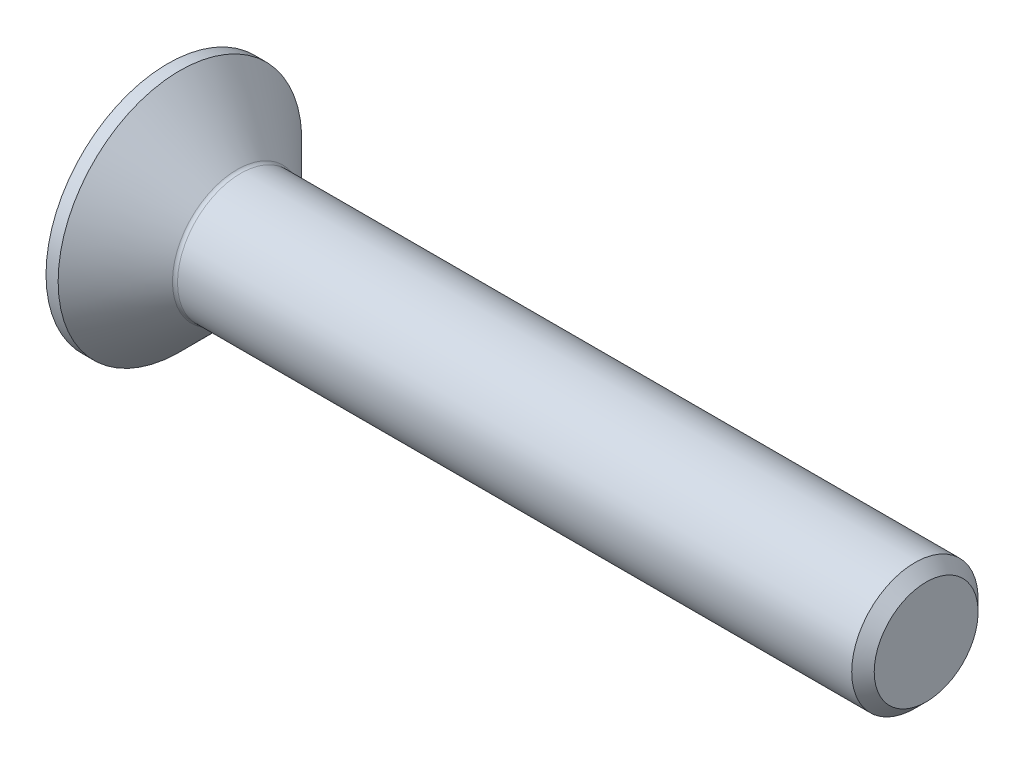
ISO-10303-21;
HEADER;
FILE_DESCRIPTION(('STEP AP214'),'2;1');
FILE_NAME('part.step','',(''),(''),'','','');
FILE_SCHEMA(('AUTOMOTIVE_DESIGN { 1 0 10303 214 1 1 1 1 }'));
ENDSEC;
DATA;
#1=APPLICATION_CONTEXT('core data for automotive mechanical design processes');
#2=APPLICATION_PROTOCOL_DEFINITION('international standard','automotive_design',2000,#1);
#3=PRODUCT_CONTEXT('',#1,'mechanical');
#4=PRODUCT('Part','Part','',(#3));
#5=PRODUCT_RELATED_PRODUCT_CATEGORY('part','',(#4));
#6=PRODUCT_DEFINITION_FORMATION('','',#4);
#7=PRODUCT_DEFINITION_CONTEXT('part definition',#1,'design');
#8=PRODUCT_DEFINITION('design','',#6,#7);
#9=PRODUCT_DEFINITION_SHAPE('','',#8);
#10=(LENGTH_UNIT() NAMED_UNIT(*) SI_UNIT(.MILLI.,.METRE.));
#11=(NAMED_UNIT(*) PLANE_ANGLE_UNIT() SI_UNIT($,.RADIAN.));
#12=(NAMED_UNIT(*) SI_UNIT($,.STERADIAN.) SOLID_ANGLE_UNIT());
#13=UNCERTAINTY_MEASURE_WITH_UNIT(LENGTH_MEASURE(1.E-05),#10,'distance_accuracy_value','');
#14=(GEOMETRIC_REPRESENTATION_CONTEXT(3) GLOBAL_UNCERTAINTY_ASSIGNED_CONTEXT((#13)) GLOBAL_UNIT_ASSIGNED_CONTEXT((#10,
#11,#12)) REPRESENTATION_CONTEXT('',''));
#15=CARTESIAN_POINT('',(0.,0.,0.));
#16=DIRECTION('',(0.,0.,1.));
#17=DIRECTION('',(1.,0.,0.));
#18=AXIS2_PLACEMENT_3D('',#15,#16,#17);
#19=CARTESIAN_POINT('',(0.,0.,0.));
#20=DIRECTION('',(-1.,0.,0.));
#21=DIRECTION('',(0.,0.,1.));
#22=AXIS2_PLACEMENT_3D('',#19,#20,#21);
#23=PLANE('',#22);
#24=CARTESIAN_POINT('',(0.,0.,0.));
#25=DIRECTION('',(-1.,0.,0.));
#26=DIRECTION('',(0.,0.,1.));
#27=AXIS2_PLACEMENT_3D('',#24,#25,#26);
#28=CIRCLE('',#27,4.82);
#29=CARTESIAN_POINT('',(0.,0.,4.82));
#30=VERTEX_POINT('',#29);
#31=EDGE_CURVE('E153',#30,#30,#28,.T.);
#32=ORIENTED_EDGE('',*,*,#31,.T.);
#33=EDGE_LOOP('',(#32));
#34=FACE_BOUND('',#33,.T.);
#35=DIRECTION('',(0.,-0.5,-0.866025403784439));
#36=VECTOR('',#35,1.);
#37=CARTESIAN_POINT('',(0.,-0.871798906476334,1.51));
#38=LINE('',#37,#36);
#39=CARTESIAN_POINT('',(0.,-0.871798906476334,1.51));
#40=VERTEX_POINT('',#39);
#41=CARTESIAN_POINT('',(0.,-1.74359781295267,0.));
#42=VERTEX_POINT('',#41);
#43=EDGE_CURVE('E119',#40,#42,#38,.T.);
#44=ORIENTED_EDGE('',*,*,#43,.T.);
#45=DIRECTION('',(0.,0.5,-0.866025403784439));
#46=VECTOR('',#45,1.);
#47=CARTESIAN_POINT('',(0.,-1.74359781295267,0.));
#48=LINE('',#47,#46);
#49=CARTESIAN_POINT('',(0.,-0.871798906476334,-1.51));
#50=VERTEX_POINT('',#49);
#51=EDGE_CURVE('E50',#42,#50,#48,.T.);
#52=ORIENTED_EDGE('',*,*,#51,.T.);
#53=DIRECTION('',(0.,1.,0.));
#54=VECTOR('',#53,1.);
#55=CARTESIAN_POINT('',(0.,-0.871798906476334,-1.51));
#56=LINE('',#55,#54);
#57=CARTESIAN_POINT('',(0.,0.871798906476336,-1.51));
#58=VERTEX_POINT('',#57);
#59=EDGE_CURVE('E130',#50,#58,#56,.T.);
#60=ORIENTED_EDGE('',*,*,#59,.T.);
#61=DIRECTION('',(0.,0.5,0.866025403784439));
#62=VECTOR('',#61,1.);
#63=CARTESIAN_POINT('',(0.,0.871798906476336,-1.51));
#64=LINE('',#63,#62);
#65=CARTESIAN_POINT('',(0.,1.74359781295267,0.));
#66=VERTEX_POINT('',#65);
#67=EDGE_CURVE('E254',#58,#66,#64,.T.);
#68=ORIENTED_EDGE('',*,*,#67,.T.);
#69=DIRECTION('',(0.,-0.5,0.866025403784439));
#70=VECTOR('',#69,1.);
#71=CARTESIAN_POINT('',(0.,1.74359781295267,0.));
#72=LINE('',#71,#70);
#73=CARTESIAN_POINT('',(0.,0.871798906476336,1.51));
#74=VERTEX_POINT('',#73);
#75=EDGE_CURVE('E257',#66,#74,#72,.T.);
#76=ORIENTED_EDGE('',*,*,#75,.T.);
#77=DIRECTION('',(0.,-1.,0.));
#78=VECTOR('',#77,1.);
#79=CARTESIAN_POINT('',(0.,0.871798906476336,1.51));
#80=LINE('',#79,#78);
#81=EDGE_CURVE('E260',#74,#40,#80,.T.);
#82=ORIENTED_EDGE('',*,*,#81,.T.);
#83=EDGE_LOOP('',(#44,#52,#60,#68,#76,#82));
#84=FACE_BOUND('',#83,.T.);
#85=ADVANCED_FACE('F35',(#34,#84),#23,.T.);
#86=CARTESIAN_POINT('',(0.,0.,0.));
#87=DIRECTION('',(-1.,0.,0.));
#88=DIRECTION('',(0.,0.,1.));
#89=AXIS2_PLACEMENT_3D('',#86,#87,#88);
#90=CYLINDRICAL_SURFACE('',#89,4.82);
#91=CARTESIAN_POINT('',(0.48000000000001,0.,0.));
#92=DIRECTION('',(-1.,0.,0.));
#93=DIRECTION('',(0.,0.,1.));
#94=AXIS2_PLACEMENT_3D('',#91,#92,#93);
#95=CIRCLE('',#94,4.82);
#96=CARTESIAN_POINT('',(0.48000000000001,0.,4.82));
#97=VERTEX_POINT('',#96);
#98=EDGE_CURVE('E150',#97,#97,#95,.T.);
#99=ORIENTED_EDGE('',*,*,#98,.T.);
#100=EDGE_LOOP('',(#99));
#101=FACE_BOUND('',#100,.T.);
#102=ORIENTED_EDGE('',*,*,#31,.F.);
#103=EDGE_LOOP('',(#102));
#104=FACE_BOUND('',#103,.T.);
#105=ADVANCED_FACE('F174',(#101,#104),#90,.T.);
#106=CARTESIAN_POINT('',(0.48000000000001,0.,0.));
#107=DIRECTION('',(-1.,0.,0.));
#108=DIRECTION('',(0.,0.,1.));
#109=AXIS2_PLACEMENT_3D('',#106,#107,#108);
#110=CONICAL_SURFACE('',#109,4.82,0.78539816339745);
#111=CARTESIAN_POINT('',(2.74142135623735,0.,0.));
#112=DIRECTION('',(-1.,0.,0.));
#113=DIRECTION('',(0.,0.,1.));
#114=AXIS2_PLACEMENT_3D('',#111,#112,#113);
#115=CIRCLE('',#114,2.55857864376265);
#116=CARTESIAN_POINT('',(2.74142135623735,0.,2.55857864376265));
#117=VERTEX_POINT('',#116);
#118=EDGE_CURVE('E43',#117,#117,#115,.T.);
#119=ORIENTED_EDGE('',*,*,#118,.T.);
#120=EDGE_LOOP('',(#119));
#121=FACE_BOUND('',#120,.T.);
#122=ORIENTED_EDGE('',*,*,#98,.F.);
#123=EDGE_LOOP('',(#122));
#124=FACE_BOUND('',#123,.T.);
#125=ADVANCED_FACE('F158',(#121,#124),#110,.T.);
#126=CARTESIAN_POINT('',(0.,0.,0.));
#127=DIRECTION('',(-1.,0.,0.));
#128=DIRECTION('',(0.,0.,1.));
#129=AXIS2_PLACEMENT_3D('',#126,#127,#128);
#130=CYLINDRICAL_SURFACE('',#129,2.49999999999996);
#131=CARTESIAN_POINT('',(2.88284271247466,0.,0.));
#132=DIRECTION('',(-1.,0.,0.));
#133=DIRECTION('',(0.,0.,1.));
#134=AXIS2_PLACEMENT_3D('',#131,#132,#133);
#135=CIRCLE('',#134,2.49999999999996);
#136=CARTESIAN_POINT('',(2.88284271247466,0.,2.49999999999996));
#137=VERTEX_POINT('',#136);
#138=EDGE_CURVE('E11',#137,#137,#135,.F.);
#139=ORIENTED_EDGE('',*,*,#138,.T.);
#140=EDGE_LOOP('',(#139));
#141=FACE_BOUND('',#140,.T.);
#142=CARTESIAN_POINT('',(29.5549999999999,0.,0.));
#143=DIRECTION('',(-1.,0.,0.));
#144=DIRECTION('',(0.,0.,1.));
#145=AXIS2_PLACEMENT_3D('',#142,#143,#144);
#146=CIRCLE('',#145,2.49999999999993);
#147=CARTESIAN_POINT('',(29.5549999999999,0.,2.49999999999993));
#148=VERTEX_POINT('',#147);
#149=EDGE_CURVE('E147',#148,#148,#146,.T.);
#150=ORIENTED_EDGE('',*,*,#149,.T.);
#151=EDGE_LOOP('',(#150));
#152=FACE_BOUND('',#151,.T.);
#153=ADVANCED_FACE('F185',(#141,#152),#130,.T.);
#154=CARTESIAN_POINT('',(30.,0.,0.));
#155=DIRECTION('',(-1.,0.,0.));
#156=DIRECTION('',(0.,0.,1.));
#157=AXIS2_PLACEMENT_3D('',#154,#155,#156);
#158=CONICAL_SURFACE('',#157,2.055,0.785398163397304);
#159=ORIENTED_EDGE('',*,*,#149,.F.);
#160=EDGE_LOOP('',(#159));
#161=FACE_BOUND('',#160,.T.);
#162=CARTESIAN_POINT('',(30.,0.,0.));
#163=DIRECTION('',(-1.,0.,0.));
#164=DIRECTION('',(0.,0.,1.));
#165=AXIS2_PLACEMENT_3D('',#162,#163,#164);
#166=CIRCLE('',#165,2.055);
#167=CARTESIAN_POINT('',(30.,0.,2.055));
#168=VERTEX_POINT('',#167);
#169=EDGE_CURVE('E143',#168,#168,#166,.T.);
#170=ORIENTED_EDGE('',*,*,#169,.T.);
#171=EDGE_LOOP('',(#170));
#172=FACE_BOUND('',#171,.T.);
#173=ADVANCED_FACE('F169',(#161,#172),#158,.T.);
#174=CARTESIAN_POINT('',(30.,2.055,0.));
#175=DIRECTION('',(1.,0.,0.));
#176=DIRECTION('',(0.,0.,-1.));
#177=AXIS2_PLACEMENT_3D('',#174,#175,#176);
#178=PLANE('',#177);
#179=ORIENTED_EDGE('',*,*,#169,.F.);
#180=EDGE_LOOP('',(#179));
#181=FACE_BOUND('',#180,.T.);
#182=ADVANCED_FACE('F162',(#181),#178,.T.);
#183=CARTESIAN_POINT('',(2.88284271247466,0.,0.));
#184=DIRECTION('',(-1.,0.,0.));
#185=DIRECTION('',(0.,0.,1.));
#186=AXIS2_PLACEMENT_3D('',#183,#184,#185);
#187=TOROIDAL_SURFACE('',#186,2.69999999999996,0.2);
#188=ORIENTED_EDGE('',*,*,#138,.F.);
#189=EDGE_LOOP('',(#188));
#190=FACE_BOUND('',#189,.T.);
#191=ORIENTED_EDGE('',*,*,#118,.F.);
#192=EDGE_LOOP('',(#191));
#193=FACE_BOUND('',#192,.T.);
#194=ADVANCED_FACE('F37',(#190,#193),#187,.F.);
#195=CARTESIAN_POINT('',(2.3,-1.74359781295267,0.));
#196=DIRECTION('',(0.,0.866025403784439,0.5));
#197=DIRECTION('',(0.,-0.5,0.866025403784439));
#198=AXIS2_PLACEMENT_3D('',#195,#196,#197);
#199=PLANE('',#198);
#200=ORIENTED_EDGE('',*,*,#51,.F.);
#201=DIRECTION('',(-1.,0.,0.));
#202=VECTOR('',#201,1.);
#203=CARTESIAN_POINT('',(2.3,-1.74359781295267,0.));
#204=LINE('',#203,#202);
#205=CARTESIAN_POINT('',(2.3,-1.74359781295267,0.));
#206=VERTEX_POINT('',#205);
#207=EDGE_CURVE('E251',#206,#42,#204,.T.);
#208=ORIENTED_EDGE('',*,*,#207,.F.);
#209=DIRECTION('',(0.,0.5,-0.866025403784439));
#210=VECTOR('',#209,1.);
#211=CARTESIAN_POINT('',(2.3,-1.74359781295267,0.));
#212=LINE('',#211,#210);
#213=CARTESIAN_POINT('',(2.3,-1.3076983597145,-0.754999999999998));
#214=VERTEX_POINT('',#213);
#215=EDGE_CURVE('E115',#206,#214,#212,.T.);
#216=ORIENTED_EDGE('',*,*,#215,.T.);
#217=CARTESIAN_POINT('',(2.3,-0.871798906476334,-1.51));
#218=VERTEX_POINT('',#217);
#219=EDGE_CURVE('E111',#214,#218,#212,.T.);
#220=ORIENTED_EDGE('',*,*,#219,.T.);
#221=DIRECTION('',(-1.,0.,0.));
#222=VECTOR('',#221,1.);
#223=CARTESIAN_POINT('',(2.3,-0.871798906476334,-1.51));
#224=LINE('',#223,#222);
#225=EDGE_CURVE('E113',#218,#50,#224,.T.);
#226=ORIENTED_EDGE('',*,*,#225,.T.);
#227=EDGE_LOOP('',(#200,#208,#216,#220,#226));
#228=FACE_BOUND('',#227,.T.);
#229=ADVANCED_FACE('F112',(#228),#199,.T.);
#230=CARTESIAN_POINT('',(2.3,-0.871798906476334,-1.51));
#231=DIRECTION('',(0.,0.,1.));
#232=DIRECTION('',(1.,0.,0.));
#233=AXIS2_PLACEMENT_3D('',#230,#231,#232);
#234=PLANE('',#233);
#235=ORIENTED_EDGE('',*,*,#59,.F.);
#236=ORIENTED_EDGE('',*,*,#225,.F.);
#237=DIRECTION('',(0.,1.,0.));
#238=VECTOR('',#237,1.);
#239=CARTESIAN_POINT('',(2.3,-0.871798906476334,-1.51));
#240=LINE('',#239,#238);
#241=CARTESIAN_POINT('',(2.3,0.,-1.51));
#242=VERTEX_POINT('',#241);
#243=EDGE_CURVE('E58',#218,#242,#240,.T.);
#244=ORIENTED_EDGE('',*,*,#243,.T.);
#245=CARTESIAN_POINT('',(2.3,0.871798906476336,-1.51));
#246=VERTEX_POINT('',#245);
#247=EDGE_CURVE('E125',#242,#246,#240,.T.);
#248=ORIENTED_EDGE('',*,*,#247,.T.);
#249=DIRECTION('',(-1.,0.,0.));
#250=VECTOR('',#249,1.);
#251=CARTESIAN_POINT('',(2.3,0.871798906476336,-1.51));
#252=LINE('',#251,#250);
#253=EDGE_CURVE('E132',#246,#58,#252,.T.);
#254=ORIENTED_EDGE('',*,*,#253,.T.);
#255=EDGE_LOOP('',(#235,#236,#244,#248,#254));
#256=FACE_BOUND('',#255,.T.);
#257=ADVANCED_FACE('F127',(#256),#234,.T.);
#258=CARTESIAN_POINT('',(2.3,0.871798906476336,-1.51));
#259=DIRECTION('',(0.,-0.866025403784439,0.5));
#260=DIRECTION('',(0.,-0.5,-0.866025403784439));
#261=AXIS2_PLACEMENT_3D('',#258,#259,#260);
#262=PLANE('',#261);
#263=ORIENTED_EDGE('',*,*,#67,.F.);
#264=ORIENTED_EDGE('',*,*,#253,.F.);
#265=DIRECTION('',(0.,0.5,0.866025403784439));
#266=VECTOR('',#265,1.);
#267=CARTESIAN_POINT('',(2.3,0.871798906476336,-1.51));
#268=LINE('',#267,#266);
#269=CARTESIAN_POINT('',(2.3,1.3076983597145,-0.755));
#270=VERTEX_POINT('',#269);
#271=EDGE_CURVE('E232',#246,#270,#268,.T.);
#272=ORIENTED_EDGE('',*,*,#271,.T.);
#273=CARTESIAN_POINT('',(2.3,1.74359781295267,0.));
#274=VERTEX_POINT('',#273);
#275=EDGE_CURVE('E124',#270,#274,#268,.T.);
#276=ORIENTED_EDGE('',*,*,#275,.T.);
#277=DIRECTION('',(-1.,0.,0.));
#278=VECTOR('',#277,1.);
#279=CARTESIAN_POINT('',(2.3,1.74359781295267,0.));
#280=LINE('',#279,#278);
#281=EDGE_CURVE('E138',#274,#66,#280,.T.);
#282=ORIENTED_EDGE('',*,*,#281,.T.);
#283=EDGE_LOOP('',(#263,#264,#272,#276,#282));
#284=FACE_BOUND('',#283,.T.);
#285=ADVANCED_FACE('F199',(#284),#262,.T.);
#286=CARTESIAN_POINT('',(2.3,1.74359781295267,0.));
#287=DIRECTION('',(0.,-0.866025403784439,-0.5));
#288=DIRECTION('',(0.,0.5,-0.866025403784439));
#289=AXIS2_PLACEMENT_3D('',#286,#287,#288);
#290=PLANE('',#289);
#291=ORIENTED_EDGE('',*,*,#75,.F.);
#292=ORIENTED_EDGE('',*,*,#281,.F.);
#293=DIRECTION('',(0.,-0.5,0.866025403784439));
#294=VECTOR('',#293,1.);
#295=CARTESIAN_POINT('',(2.3,1.74359781295267,0.));
#296=LINE('',#295,#294);
#297=CARTESIAN_POINT('',(2.3,1.3076983597145,0.755));
#298=VERTEX_POINT('',#297);
#299=EDGE_CURVE('E239',#274,#298,#296,.T.);
#300=ORIENTED_EDGE('',*,*,#299,.T.);
#301=CARTESIAN_POINT('',(2.3,0.871798906476336,1.51));
#302=VERTEX_POINT('',#301);
#303=EDGE_CURVE('E237',#298,#302,#296,.T.);
#304=ORIENTED_EDGE('',*,*,#303,.T.);
#305=DIRECTION('',(-1.,0.,0.));
#306=VECTOR('',#305,1.);
#307=CARTESIAN_POINT('',(2.3,0.871798906476336,1.51));
#308=LINE('',#307,#306);
#309=EDGE_CURVE('E269',#302,#74,#308,.T.);
#310=ORIENTED_EDGE('',*,*,#309,.T.);
#311=EDGE_LOOP('',(#291,#292,#300,#304,#310));
#312=FACE_BOUND('',#311,.T.);
#313=ADVANCED_FACE('F202',(#312),#290,.T.);
#314=CARTESIAN_POINT('',(2.3,0.871798906476336,1.51));
#315=DIRECTION('',(0.,0.,-1.));
#316=DIRECTION('',(-1.,0.,0.));
#317=AXIS2_PLACEMENT_3D('',#314,#315,#316);
#318=PLANE('',#317);
#319=ORIENTED_EDGE('',*,*,#81,.F.);
#320=ORIENTED_EDGE('',*,*,#309,.F.);
#321=DIRECTION('',(0.,-1.,0.));
#322=VECTOR('',#321,1.);
#323=CARTESIAN_POINT('',(2.3,0.871798906476336,1.51));
#324=LINE('',#323,#322);
#325=CARTESIAN_POINT('',(2.3,0.,1.51));
#326=VERTEX_POINT('',#325);
#327=EDGE_CURVE('E244',#302,#326,#324,.T.);
#328=ORIENTED_EDGE('',*,*,#327,.T.);
#329=CARTESIAN_POINT('',(2.3,-0.871798906476334,1.51));
#330=VERTEX_POINT('',#329);
#331=EDGE_CURVE('E243',#326,#330,#324,.T.);
#332=ORIENTED_EDGE('',*,*,#331,.T.);
#333=DIRECTION('',(-1.,0.,0.));
#334=VECTOR('',#333,1.);
#335=CARTESIAN_POINT('',(2.3,-0.871798906476334,1.51));
#336=LINE('',#335,#334);
#337=EDGE_CURVE('E266',#330,#40,#336,.T.);
#338=ORIENTED_EDGE('',*,*,#337,.T.);
#339=EDGE_LOOP('',(#319,#320,#328,#332,#338));
#340=FACE_BOUND('',#339,.T.);
#341=ADVANCED_FACE('F206',(#340),#318,.T.);
#342=CARTESIAN_POINT('',(2.3,-0.871798906476334,1.51));
#343=DIRECTION('',(0.,0.866025403784439,-0.5));
#344=DIRECTION('',(0.,0.5,0.866025403784439));
#345=AXIS2_PLACEMENT_3D('',#342,#343,#344);
#346=PLANE('',#345);
#347=ORIENTED_EDGE('',*,*,#43,.F.);
#348=ORIENTED_EDGE('',*,*,#337,.F.);
#349=DIRECTION('',(0.,-0.5,-0.866025403784439));
#350=VECTOR('',#349,1.);
#351=CARTESIAN_POINT('',(2.3,-0.871798906476334,1.51));
#352=LINE('',#351,#350);
#353=CARTESIAN_POINT('',(2.3,-1.3076983597145,0.754999999999999));
#354=VERTEX_POINT('',#353);
#355=EDGE_CURVE('E248',#330,#354,#352,.T.);
#356=ORIENTED_EDGE('',*,*,#355,.T.);
#357=EDGE_CURVE('E247',#354,#206,#352,.T.);
#358=ORIENTED_EDGE('',*,*,#357,.T.);
#359=ORIENTED_EDGE('',*,*,#207,.T.);
#360=EDGE_LOOP('',(#347,#348,#356,#358,#359));
#361=FACE_BOUND('',#360,.T.);
#362=ADVANCED_FACE('F210',(#361),#346,.T.);
#363=CARTESIAN_POINT('',(2.3,-0.871798906476333,-1.51));
#364=DIRECTION('',(1.,0.,0.));
#365=DIRECTION('',(0.,0.,-1.));
#366=AXIS2_PLACEMENT_3D('',#363,#364,#365);
#367=PLANE('',#366);
#368=ORIENTED_EDGE('',*,*,#243,.F.);
#369=ORIENTED_EDGE('',*,*,#219,.F.);
#370=CARTESIAN_POINT('',(2.3,0.,0.));
#371=DIRECTION('',(-1.,0.,0.));
#372=DIRECTION('',(0.,0.,1.));
#373=AXIS2_PLACEMENT_3D('',#370,#371,#372);
#374=CIRCLE('',#373,1.51);
#375=EDGE_CURVE('E122',#242,#214,#374,.T.);
#376=ORIENTED_EDGE('',*,*,#375,.F.);
#377=EDGE_LOOP('',(#368,#369,#376));
#378=FACE_BOUND('',#377,.T.);
#379=ADVANCED_FACE('F121',(#378),#367,.F.);
#380=ORIENTED_EDGE('',*,*,#215,.F.);
#381=ORIENTED_EDGE('',*,*,#357,.F.);
#382=EDGE_CURVE('E135',#214,#354,#374,.T.);
#383=ORIENTED_EDGE('',*,*,#382,.F.);
#384=EDGE_LOOP('',(#380,#381,#383));
#385=FACE_BOUND('',#384,.T.);
#386=ADVANCED_FACE('F216',(#385),#367,.F.);
#387=ORIENTED_EDGE('',*,*,#355,.F.);
#388=ORIENTED_EDGE('',*,*,#331,.F.);
#389=EDGE_CURVE('E131',#354,#326,#374,.T.);
#390=ORIENTED_EDGE('',*,*,#389,.F.);
#391=EDGE_LOOP('',(#387,#388,#390));
#392=FACE_BOUND('',#391,.T.);
#393=ADVANCED_FACE('F220',(#392),#367,.F.);
#394=ORIENTED_EDGE('',*,*,#327,.F.);
#395=ORIENTED_EDGE('',*,*,#303,.F.);
#396=EDGE_CURVE('E137',#326,#298,#374,.T.);
#397=ORIENTED_EDGE('',*,*,#396,.F.);
#398=EDGE_LOOP('',(#394,#395,#397));
#399=FACE_BOUND('',#398,.T.);
#400=ADVANCED_FACE('F228',(#399),#367,.F.);
#401=ORIENTED_EDGE('',*,*,#299,.F.);
#402=ORIENTED_EDGE('',*,*,#275,.F.);
#403=EDGE_CURVE('E144',#298,#270,#374,.T.);
#404=ORIENTED_EDGE('',*,*,#403,.F.);
#405=EDGE_LOOP('',(#401,#402,#404));
#406=FACE_BOUND('',#405,.T.);
#407=ADVANCED_FACE('F223',(#406),#367,.F.);
#408=ORIENTED_EDGE('',*,*,#271,.F.);
#409=ORIENTED_EDGE('',*,*,#247,.F.);
#410=EDGE_CURVE('E233',#270,#242,#374,.T.);
#411=ORIENTED_EDGE('',*,*,#410,.F.);
#412=EDGE_LOOP('',(#408,#409,#411));
#413=FACE_BOUND('',#412,.T.);
#414=ADVANCED_FACE('F194',(#413),#367,.F.);
#415=CARTESIAN_POINT('',(2.3,0.,0.));
#416=DIRECTION('',(-1.,0.,0.));
#417=DIRECTION('',(0.,0.,1.));
#418=AXIS2_PLACEMENT_3D('',#415,#416,#417);
#419=CONICAL_SURFACE('',#418,1.51,1.04719755119659);
#420=CARTESIAN_POINT('',(3.17179890647634,0.,0.));
#421=VERTEX_POINT('',#420);
#422=VERTEX_LOOP('',#421);
#423=FACE_BOUND('',#422,.T.);
#424=ORIENTED_EDGE('',*,*,#396,.T.);
#425=ORIENTED_EDGE('',*,*,#403,.T.);
#426=ORIENTED_EDGE('',*,*,#410,.T.);
#427=ORIENTED_EDGE('',*,*,#375,.T.);
#428=ORIENTED_EDGE('',*,*,#382,.T.);
#429=ORIENTED_EDGE('',*,*,#389,.T.);
#430=EDGE_LOOP('',(#424,#425,#426,#427,#428,#429));
#431=FACE_BOUND('',#430,.T.);
#432=ADVANCED_FACE('F192',(#423,#431),#419,.F.);
#433=CLOSED_SHELL('',(#85,#105,#125,#153,#173,#182,#194,#229,#257,#285,#313,#341,#362,#379,#386,
#393,#400,#407,#414,#432));
#434=MANIFOLD_SOLID_BREP('B2',#433);
#435=ADVANCED_BREP_SHAPE_REPRESENTATION('',(#18,#434),#14);
#436=SHAPE_DEFINITION_REPRESENTATION(#9,#435);
ENDSEC;
END-ISO-10303-21;
